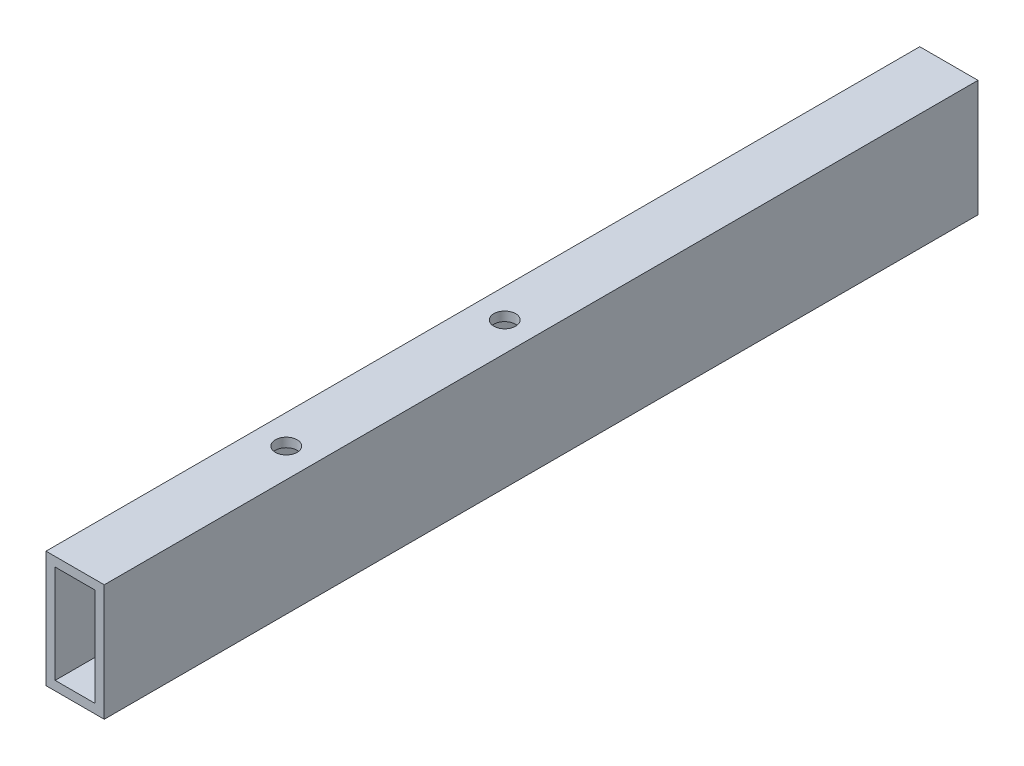
ISO-10303-21;
HEADER;
FILE_DESCRIPTION(('STEP AP214'),'2;1');
FILE_NAME('part.step','',(''),(''),'','','');
FILE_SCHEMA(('AUTOMOTIVE_DESIGN { 1 0 10303 214 1 1 1 1 }'));
ENDSEC;
DATA;
#1=APPLICATION_CONTEXT('core data for automotive mechanical design processes');
#2=APPLICATION_PROTOCOL_DEFINITION('international standard','automotive_design',2000,#1);
#3=PRODUCT_CONTEXT('',#1,'mechanical');
#4=PRODUCT('Part','Part','',(#3));
#5=PRODUCT_RELATED_PRODUCT_CATEGORY('part','',(#4));
#6=PRODUCT_DEFINITION_FORMATION('','',#4);
#7=PRODUCT_DEFINITION_CONTEXT('part definition',#1,'design');
#8=PRODUCT_DEFINITION('design','',#6,#7);
#9=PRODUCT_DEFINITION_SHAPE('','',#8);
#10=(LENGTH_UNIT() NAMED_UNIT(*) SI_UNIT(.MILLI.,.METRE.));
#11=(NAMED_UNIT(*) PLANE_ANGLE_UNIT() SI_UNIT($,.RADIAN.));
#12=(NAMED_UNIT(*) SI_UNIT($,.STERADIAN.) SOLID_ANGLE_UNIT());
#13=UNCERTAINTY_MEASURE_WITH_UNIT(LENGTH_MEASURE(1.E-05),#10,'distance_accuracy_value','');
#14=(GEOMETRIC_REPRESENTATION_CONTEXT(3) GLOBAL_UNCERTAINTY_ASSIGNED_CONTEXT((#13)) GLOBAL_UNIT_ASSIGNED_CONTEXT((#10,
#11,#12)) REPRESENTATION_CONTEXT('',''));
#15=CARTESIAN_POINT('',(0.,0.,0.));
#16=DIRECTION('',(0.,0.,1.));
#17=DIRECTION('',(1.,0.,0.));
#18=AXIS2_PLACEMENT_3D('',#15,#16,#17);
#19=CARTESIAN_POINT('',(-20.,40.,300.));
#20=DIRECTION('',(1.,0.,0.));
#21=DIRECTION('',(0.,0.,-1.));
#22=AXIS2_PLACEMENT_3D('',#19,#20,#21);
#23=PLANE('',#22);
#24=DIRECTION('',(0.,0.,-1.));
#25=VECTOR('',#24,1.);
#26=CARTESIAN_POINT('',(-20.,-40.,300.));
#27=LINE('',#26,#25);
#28=CARTESIAN_POINT('',(-20.,-40.,300.));
#29=VERTEX_POINT('',#28);
#30=CARTESIAN_POINT('',(-20.,-40.,-300.));
#31=VERTEX_POINT('',#30);
#32=EDGE_CURVE('E98',#29,#31,#27,.T.);
#33=ORIENTED_EDGE('',*,*,#32,.F.);
#34=DIRECTION('',(0.,-1.,0.));
#35=VECTOR('',#34,1.);
#36=CARTESIAN_POINT('',(-20.,40.,300.));
#37=LINE('',#36,#35);
#38=CARTESIAN_POINT('',(-20.,40.,300.));
#39=VERTEX_POINT('',#38);
#40=EDGE_CURVE('E86',#39,#29,#37,.T.);
#41=ORIENTED_EDGE('',*,*,#40,.F.);
#42=DIRECTION('',(0.,0.,-1.));
#43=VECTOR('',#42,1.);
#44=CARTESIAN_POINT('',(-20.,40.,300.));
#45=LINE('',#44,#43);
#46=CARTESIAN_POINT('',(-20.,40.,-300.));
#47=VERTEX_POINT('',#46);
#48=EDGE_CURVE('E103',#39,#47,#45,.T.);
#49=ORIENTED_EDGE('',*,*,#48,.T.);
#50=DIRECTION('',(0.,-1.,0.));
#51=VECTOR('',#50,1.);
#52=CARTESIAN_POINT('',(-20.,40.,-300.));
#53=LINE('',#52,#51);
#54=EDGE_CURVE('E99',#47,#31,#53,.T.);
#55=ORIENTED_EDGE('',*,*,#54,.T.);
#56=EDGE_LOOP('',(#33,#41,#49,#55));
#57=FACE_BOUND('',#56,.T.);
#58=ADVANCED_FACE('F34',(#57),#23,.F.);
#59=CARTESIAN_POINT('',(-20.,-40.,300.));
#60=DIRECTION('',(0.,1.,0.));
#61=DIRECTION('',(-1.,0.,0.));
#62=AXIS2_PLACEMENT_3D('',#59,#60,#61);
#63=PLANE('',#62);
#64=CARTESIAN_POINT('',(0.,-40.,155.));
#65=DIRECTION('',(0.,1.,0.));
#66=DIRECTION('',(0.,0.,1.));
#67=AXIS2_PLACEMENT_3D('',#64,#65,#66);
#68=CIRCLE('',#67,7.49999999999999);
#69=CARTESIAN_POINT('',(0.,-40.,162.5));
#70=VERTEX_POINT('',#69);
#71=EDGE_CURVE('E217',#70,#70,#68,.T.);
#72=ORIENTED_EDGE('',*,*,#71,.T.);
#73=EDGE_LOOP('',(#72));
#74=FACE_BOUND('',#73,.T.);
#75=CARTESIAN_POINT('',(0.,-40.,5.));
#76=DIRECTION('',(0.,1.,0.));
#77=DIRECTION('',(0.,0.,1.));
#78=AXIS2_PLACEMENT_3D('',#75,#76,#77);
#79=CIRCLE('',#78,7.49999999999999);
#80=CARTESIAN_POINT('',(0.,-40.,12.5));
#81=VERTEX_POINT('',#80);
#82=EDGE_CURVE('E122',#81,#81,#79,.T.);
#83=ORIENTED_EDGE('',*,*,#82,.T.);
#84=EDGE_LOOP('',(#83));
#85=FACE_BOUND('',#84,.T.);
#86=DIRECTION('',(0.,0.,-1.));
#87=VECTOR('',#86,1.);
#88=CARTESIAN_POINT('',(20.,-40.,300.));
#89=LINE('',#88,#87);
#90=CARTESIAN_POINT('',(20.,-40.,300.));
#91=VERTEX_POINT('',#90);
#92=CARTESIAN_POINT('',(20.,-40.,-300.));
#93=VERTEX_POINT('',#92);
#94=EDGE_CURVE('E102',#91,#93,#89,.T.);
#95=ORIENTED_EDGE('',*,*,#94,.F.);
#96=DIRECTION('',(1.,0.,0.));
#97=VECTOR('',#96,1.);
#98=CARTESIAN_POINT('',(-20.,-40.,300.));
#99=LINE('',#98,#97);
#100=EDGE_CURVE('E83',#29,#91,#99,.T.);
#101=ORIENTED_EDGE('',*,*,#100,.F.);
#102=ORIENTED_EDGE('',*,*,#32,.T.);
#103=DIRECTION('',(1.,0.,0.));
#104=VECTOR('',#103,1.);
#105=CARTESIAN_POINT('',(-20.,-40.,-300.));
#106=LINE('',#105,#104);
#107=EDGE_CURVE('E167',#31,#93,#106,.T.);
#108=ORIENTED_EDGE('',*,*,#107,.T.);
#109=EDGE_LOOP('',(#95,#101,#102,#108));
#110=FACE_BOUND('',#109,.T.);
#111=ADVANCED_FACE('F105',(#74,#85,#110),#63,.F.);
#112=CARTESIAN_POINT('',(20.,40.,300.));
#113=DIRECTION('',(-1.,0.,0.));
#114=DIRECTION('',(0.,-1.,0.));
#115=AXIS2_PLACEMENT_3D('',#112,#113,#114);
#116=PLANE('',#115);
#117=DIRECTION('',(0.,0.,-1.));
#118=VECTOR('',#117,1.);
#119=CARTESIAN_POINT('',(20.,40.,300.));
#120=LINE('',#119,#118);
#121=CARTESIAN_POINT('',(20.,40.,300.));
#122=VERTEX_POINT('',#121);
#123=CARTESIAN_POINT('',(20.,40.,-300.));
#124=VERTEX_POINT('',#123);
#125=EDGE_CURVE('E94',#122,#124,#120,.T.);
#126=ORIENTED_EDGE('',*,*,#125,.F.);
#127=DIRECTION('',(0.,1.,0.));
#128=VECTOR('',#127,1.);
#129=CARTESIAN_POINT('',(20.,40.,300.));
#130=LINE('',#129,#128);
#131=EDGE_CURVE('E108',#91,#122,#130,.T.);
#132=ORIENTED_EDGE('',*,*,#131,.F.);
#133=ORIENTED_EDGE('',*,*,#94,.T.);
#134=DIRECTION('',(0.,1.,0.));
#135=VECTOR('',#134,1.);
#136=CARTESIAN_POINT('',(20.,40.,-300.));
#137=LINE('',#136,#135);
#138=EDGE_CURVE('E112',#93,#124,#137,.T.);
#139=ORIENTED_EDGE('',*,*,#138,.T.);
#140=EDGE_LOOP('',(#126,#132,#133,#139));
#141=FACE_BOUND('',#140,.T.);
#142=ADVANCED_FACE('F174',(#141),#116,.F.);
#143=CARTESIAN_POINT('',(-20.,40.,300.));
#144=DIRECTION('',(0.,-1.,0.));
#145=DIRECTION('',(1.,0.,0.));
#146=AXIS2_PLACEMENT_3D('',#143,#144,#145);
#147=PLANE('',#146);
#148=CARTESIAN_POINT('',(0.,40.,155.));
#149=DIRECTION('',(0.,1.,0.));
#150=DIRECTION('',(0.,0.,1.));
#151=AXIS2_PLACEMENT_3D('',#148,#149,#150);
#152=CIRCLE('',#151,7.49999999999999);
#153=CARTESIAN_POINT('',(0.,40.,162.5));
#154=VERTEX_POINT('',#153);
#155=EDGE_CURVE('E219',#154,#154,#152,.T.);
#156=ORIENTED_EDGE('',*,*,#155,.F.);
#157=EDGE_LOOP('',(#156));
#158=FACE_BOUND('',#157,.T.);
#159=CARTESIAN_POINT('',(0.,40.,5.));
#160=DIRECTION('',(0.,1.,0.));
#161=DIRECTION('',(0.,0.,1.));
#162=AXIS2_PLACEMENT_3D('',#159,#160,#161);
#163=CIRCLE('',#162,7.49999999999999);
#164=CARTESIAN_POINT('',(0.,40.,12.5));
#165=VERTEX_POINT('',#164);
#166=EDGE_CURVE('E128',#165,#165,#163,.T.);
#167=ORIENTED_EDGE('',*,*,#166,.F.);
#168=EDGE_LOOP('',(#167));
#169=FACE_BOUND('',#168,.T.);
#170=DIRECTION('',(-1.,0.,0.));
#171=VECTOR('',#170,1.);
#172=CARTESIAN_POINT('',(-20.,40.,-300.));
#173=LINE('',#172,#171);
#174=EDGE_CURVE('E141',#124,#47,#173,.T.);
#175=ORIENTED_EDGE('',*,*,#174,.T.);
#176=ORIENTED_EDGE('',*,*,#48,.F.);
#177=DIRECTION('',(-1.,0.,0.));
#178=VECTOR('',#177,1.);
#179=CARTESIAN_POINT('',(-20.,40.,300.));
#180=LINE('',#179,#178);
#181=EDGE_CURVE('E90',#122,#39,#180,.T.);
#182=ORIENTED_EDGE('',*,*,#181,.F.);
#183=ORIENTED_EDGE('',*,*,#125,.T.);
#184=EDGE_LOOP('',(#175,#176,#182,#183));
#185=FACE_BOUND('',#184,.T.);
#186=ADVANCED_FACE('F36',(#158,#169,#185),#147,.F.);
#187=CARTESIAN_POINT('',(0.,0.,300.));
#188=DIRECTION('',(0.,0.,1.));
#189=DIRECTION('',(1.,0.,0.));
#190=AXIS2_PLACEMENT_3D('',#187,#188,#189);
#191=PLANE('',#190);
#192=DIRECTION('',(0.,-1.,0.));
#193=VECTOR('',#192,1.);
#194=CARTESIAN_POINT('',(-13.7,33.7,300.));
#195=LINE('',#194,#193);
#196=CARTESIAN_POINT('',(-13.7,-33.7,300.));
#197=VERTEX_POINT('',#196);
#198=CARTESIAN_POINT('',(-13.7,33.7,300.));
#199=VERTEX_POINT('',#198);
#200=EDGE_CURVE('E154',#197,#199,#195,.F.);
#201=ORIENTED_EDGE('',*,*,#200,.T.);
#202=DIRECTION('',(-1.,0.,0.));
#203=VECTOR('',#202,1.);
#204=CARTESIAN_POINT('',(-13.7,33.7,300.));
#205=LINE('',#204,#203);
#206=CARTESIAN_POINT('',(13.7,33.7,300.));
#207=VERTEX_POINT('',#206);
#208=EDGE_CURVE('E137',#199,#207,#205,.F.);
#209=ORIENTED_EDGE('',*,*,#208,.T.);
#210=DIRECTION('',(0.,1.,0.));
#211=VECTOR('',#210,1.);
#212=CARTESIAN_POINT('',(13.7,33.7,300.));
#213=LINE('',#212,#211);
#214=CARTESIAN_POINT('',(13.7,-33.7,300.));
#215=VERTEX_POINT('',#214);
#216=EDGE_CURVE('E140',#207,#215,#213,.F.);
#217=ORIENTED_EDGE('',*,*,#216,.T.);
#218=DIRECTION('',(1.,0.,0.));
#219=VECTOR('',#218,1.);
#220=CARTESIAN_POINT('',(-13.7,-33.7,300.));
#221=LINE('',#220,#219);
#222=EDGE_CURVE('E157',#215,#197,#221,.F.);
#223=ORIENTED_EDGE('',*,*,#222,.T.);
#224=EDGE_LOOP('',(#201,#209,#217,#223));
#225=FACE_BOUND('',#224,.T.);
#226=ORIENTED_EDGE('',*,*,#40,.T.);
#227=ORIENTED_EDGE('',*,*,#100,.T.);
#228=ORIENTED_EDGE('',*,*,#131,.T.);
#229=ORIENTED_EDGE('',*,*,#181,.T.);
#230=EDGE_LOOP('',(#226,#227,#228,#229));
#231=FACE_BOUND('',#230,.T.);
#232=ADVANCED_FACE('F88',(#225,#231),#191,.T.);
#233=CARTESIAN_POINT('',(0.,0.,-300.));
#234=DIRECTION('',(0.,0.,1.));
#235=DIRECTION('',(1.,0.,0.));
#236=AXIS2_PLACEMENT_3D('',#233,#234,#235);
#237=PLANE('',#236);
#238=DIRECTION('',(0.,-1.,0.));
#239=VECTOR('',#238,1.);
#240=CARTESIAN_POINT('',(-13.7,33.7,-300.));
#241=LINE('',#240,#239);
#242=CARTESIAN_POINT('',(-13.7,-33.7,-300.));
#243=VERTEX_POINT('',#242);
#244=CARTESIAN_POINT('',(-13.7,33.7,-300.));
#245=VERTEX_POINT('',#244);
#246=EDGE_CURVE('E11',#243,#245,#241,.F.);
#247=ORIENTED_EDGE('',*,*,#246,.F.);
#248=DIRECTION('',(1.,0.,0.));
#249=VECTOR('',#248,1.);
#250=CARTESIAN_POINT('',(-13.7,-33.7,-300.));
#251=LINE('',#250,#249);
#252=CARTESIAN_POINT('',(13.7,-33.7,-300.));
#253=VERTEX_POINT('',#252);
#254=EDGE_CURVE('E44',#253,#243,#251,.F.);
#255=ORIENTED_EDGE('',*,*,#254,.F.);
#256=DIRECTION('',(0.,1.,0.));
#257=VECTOR('',#256,1.);
#258=CARTESIAN_POINT('',(13.7,33.7,-300.));
#259=LINE('',#258,#257);
#260=CARTESIAN_POINT('',(13.7,33.7,-300.));
#261=VERTEX_POINT('',#260);
#262=EDGE_CURVE('E145',#261,#253,#259,.F.);
#263=ORIENTED_EDGE('',*,*,#262,.F.);
#264=DIRECTION('',(-1.,0.,0.));
#265=VECTOR('',#264,1.);
#266=CARTESIAN_POINT('',(-13.7,33.7,-300.));
#267=LINE('',#266,#265);
#268=EDGE_CURVE('E142',#245,#261,#267,.F.);
#269=ORIENTED_EDGE('',*,*,#268,.F.);
#270=EDGE_LOOP('',(#247,#255,#263,#269));
#271=FACE_BOUND('',#270,.T.);
#272=ORIENTED_EDGE('',*,*,#54,.F.);
#273=ORIENTED_EDGE('',*,*,#174,.F.);
#274=ORIENTED_EDGE('',*,*,#138,.F.);
#275=ORIENTED_EDGE('',*,*,#107,.F.);
#276=EDGE_LOOP('',(#272,#273,#274,#275));
#277=FACE_BOUND('',#276,.T.);
#278=ADVANCED_FACE('F176',(#271,#277),#237,.F.);
#279=CARTESIAN_POINT('',(-13.7,33.7,300.));
#280=DIRECTION('',(0.,1.,0.));
#281=DIRECTION('',(-1.,0.,0.));
#282=AXIS2_PLACEMENT_3D('',#279,#280,#281);
#283=PLANE('',#282);
#284=CARTESIAN_POINT('',(0.,33.7,155.));
#285=DIRECTION('',(0.,1.,0.));
#286=DIRECTION('',(-1.,0.,0.));
#287=AXIS2_PLACEMENT_3D('',#284,#285,#286);
#288=CIRCLE('',#287,7.49999999999999);
#289=CARTESIAN_POINT('',(-7.49999999999999,33.7,155.));
#290=VERTEX_POINT('',#289);
#291=EDGE_CURVE('E38',#290,#290,#288,.T.);
#292=ORIENTED_EDGE('',*,*,#291,.T.);
#293=EDGE_LOOP('',(#292));
#294=FACE_BOUND('',#293,.T.);
#295=CARTESIAN_POINT('',(0.,33.7,5.));
#296=DIRECTION('',(0.,1.,0.));
#297=DIRECTION('',(-1.,0.,0.));
#298=AXIS2_PLACEMENT_3D('',#295,#296,#297);
#299=CIRCLE('',#298,7.49999999999999);
#300=CARTESIAN_POINT('',(-7.49999999999999,33.7,5.));
#301=VERTEX_POINT('',#300);
#302=EDGE_CURVE('E120',#301,#301,#299,.T.);
#303=ORIENTED_EDGE('',*,*,#302,.T.);
#304=EDGE_LOOP('',(#303));
#305=FACE_BOUND('',#304,.T.);
#306=DIRECTION('',(0.,0.,-1.));
#307=VECTOR('',#306,1.);
#308=CARTESIAN_POINT('',(13.7,33.7,300.));
#309=LINE('',#308,#307);
#310=EDGE_CURVE('E147',#207,#261,#309,.T.);
#311=ORIENTED_EDGE('',*,*,#310,.F.);
#312=ORIENTED_EDGE('',*,*,#208,.F.);
#313=DIRECTION('',(0.,0.,-1.));
#314=VECTOR('',#313,1.);
#315=CARTESIAN_POINT('',(-13.7,33.7,300.));
#316=LINE('',#315,#314);
#317=EDGE_CURVE('E151',#199,#245,#316,.T.);
#318=ORIENTED_EDGE('',*,*,#317,.T.);
#319=ORIENTED_EDGE('',*,*,#268,.T.);
#320=EDGE_LOOP('',(#311,#312,#318,#319));
#321=FACE_BOUND('',#320,.T.);
#322=ADVANCED_FACE('F206',(#294,#305,#321),#283,.F.);
#323=CARTESIAN_POINT('',(13.7,33.7,300.));
#324=DIRECTION('',(1.,0.,0.));
#325=DIRECTION('',(0.,0.,-1.));
#326=AXIS2_PLACEMENT_3D('',#323,#324,#325);
#327=PLANE('',#326);
#328=DIRECTION('',(0.,0.,-1.));
#329=VECTOR('',#328,1.);
#330=CARTESIAN_POINT('',(13.7,-33.7,300.));
#331=LINE('',#330,#329);
#332=EDGE_CURVE('E150',#215,#253,#331,.T.);
#333=ORIENTED_EDGE('',*,*,#332,.F.);
#334=ORIENTED_EDGE('',*,*,#216,.F.);
#335=ORIENTED_EDGE('',*,*,#310,.T.);
#336=ORIENTED_EDGE('',*,*,#262,.T.);
#337=EDGE_LOOP('',(#333,#334,#335,#336));
#338=FACE_BOUND('',#337,.T.);
#339=ADVANCED_FACE('F200',(#338),#327,.F.);
#340=CARTESIAN_POINT('',(-13.7,-33.7,300.));
#341=DIRECTION('',(0.,-1.,0.));
#342=DIRECTION('',(1.,0.,0.));
#343=AXIS2_PLACEMENT_3D('',#340,#341,#342);
#344=PLANE('',#343);
#345=CARTESIAN_POINT('',(0.,-33.7,155.));
#346=DIRECTION('',(0.,-1.,0.));
#347=DIRECTION('',(1.,0.,0.));
#348=AXIS2_PLACEMENT_3D('',#345,#346,#347);
#349=CIRCLE('',#348,7.49999999999999);
#350=CARTESIAN_POINT('',(7.49999999999998,-33.7,155.));
#351=VERTEX_POINT('',#350);
#352=EDGE_CURVE('E133',#351,#351,#349,.T.);
#353=ORIENTED_EDGE('',*,*,#352,.T.);
#354=EDGE_LOOP('',(#353));
#355=FACE_BOUND('',#354,.T.);
#356=CARTESIAN_POINT('',(0.,-33.7,5.));
#357=DIRECTION('',(0.,-1.,0.));
#358=DIRECTION('',(1.,0.,0.));
#359=AXIS2_PLACEMENT_3D('',#356,#357,#358);
#360=CIRCLE('',#359,7.49999999999999);
#361=CARTESIAN_POINT('',(7.49999999999998,-33.7,5.));
#362=VERTEX_POINT('',#361);
#363=EDGE_CURVE('E117',#362,#362,#360,.T.);
#364=ORIENTED_EDGE('',*,*,#363,.T.);
#365=EDGE_LOOP('',(#364));
#366=FACE_BOUND('',#365,.T.);
#367=DIRECTION('',(0.,0.,-1.));
#368=VECTOR('',#367,1.);
#369=CARTESIAN_POINT('',(-13.7,-33.7,300.));
#370=LINE('',#369,#368);
#371=EDGE_CURVE('E146',#197,#243,#370,.T.);
#372=ORIENTED_EDGE('',*,*,#371,.F.);
#373=ORIENTED_EDGE('',*,*,#222,.F.);
#374=ORIENTED_EDGE('',*,*,#332,.T.);
#375=ORIENTED_EDGE('',*,*,#254,.T.);
#376=EDGE_LOOP('',(#372,#373,#374,#375));
#377=FACE_BOUND('',#376,.T.);
#378=ADVANCED_FACE('F190',(#355,#366,#377),#344,.F.);
#379=CARTESIAN_POINT('',(-13.7,33.7,300.));
#380=DIRECTION('',(-1.,0.,0.));
#381=DIRECTION('',(0.,0.,1.));
#382=AXIS2_PLACEMENT_3D('',#379,#380,#381);
#383=PLANE('',#382);
#384=ORIENTED_EDGE('',*,*,#246,.T.);
#385=ORIENTED_EDGE('',*,*,#317,.F.);
#386=ORIENTED_EDGE('',*,*,#200,.F.);
#387=ORIENTED_EDGE('',*,*,#371,.T.);
#388=EDGE_LOOP('',(#384,#385,#386,#387));
#389=FACE_BOUND('',#388,.T.);
#390=ADVANCED_FACE('F187',(#389),#383,.F.);
#391=CARTESIAN_POINT('',(0.,40.,5.));
#392=DIRECTION('',(0.,1.,0.));
#393=DIRECTION('',(0.,0.,1.));
#394=AXIS2_PLACEMENT_3D('',#391,#392,#393);
#395=CYLINDRICAL_SURFACE('',#394,7.49999999999999);
#396=ORIENTED_EDGE('',*,*,#166,.T.);
#397=EDGE_LOOP('',(#396));
#398=FACE_BOUND('',#397,.T.);
#399=ORIENTED_EDGE('',*,*,#302,.F.);
#400=EDGE_LOOP('',(#399));
#401=FACE_BOUND('',#400,.T.);
#402=ADVANCED_FACE('F189',(#398,#401),#395,.F.);
#403=ORIENTED_EDGE('',*,*,#82,.F.);
#404=EDGE_LOOP('',(#403));
#405=FACE_BOUND('',#404,.T.);
#406=ORIENTED_EDGE('',*,*,#363,.F.);
#407=EDGE_LOOP('',(#406));
#408=FACE_BOUND('',#407,.T.);
#409=ADVANCED_FACE('F197',(#405,#408),#395,.F.);
#410=CARTESIAN_POINT('',(0.,40.,155.));
#411=DIRECTION('',(0.,1.,0.));
#412=DIRECTION('',(0.,0.,1.));
#413=AXIS2_PLACEMENT_3D('',#410,#411,#412);
#414=CYLINDRICAL_SURFACE('',#413,7.49999999999999);
#415=ORIENTED_EDGE('',*,*,#155,.T.);
#416=EDGE_LOOP('',(#415));
#417=FACE_BOUND('',#416,.T.);
#418=ORIENTED_EDGE('',*,*,#291,.F.);
#419=EDGE_LOOP('',(#418));
#420=FACE_BOUND('',#419,.T.);
#421=ADVANCED_FACE('F230',(#417,#420),#414,.F.);
#422=ORIENTED_EDGE('',*,*,#71,.F.);
#423=EDGE_LOOP('',(#422));
#424=FACE_BOUND('',#423,.T.);
#425=ORIENTED_EDGE('',*,*,#352,.F.);
#426=EDGE_LOOP('',(#425));
#427=FACE_BOUND('',#426,.T.);
#428=ADVANCED_FACE('F228',(#424,#427),#414,.F.);
#429=CLOSED_SHELL('',(#58,#111,#142,#186,#232,#278,#322,#339,#378,#390,#402,#409,#421,#428));
#430=MANIFOLD_SOLID_BREP('B2',#429);
#431=ADVANCED_BREP_SHAPE_REPRESENTATION('',(#18,#430),#14);
#432=SHAPE_DEFINITION_REPRESENTATION(#9,#431);
ENDSEC;
END-ISO-10303-21;
